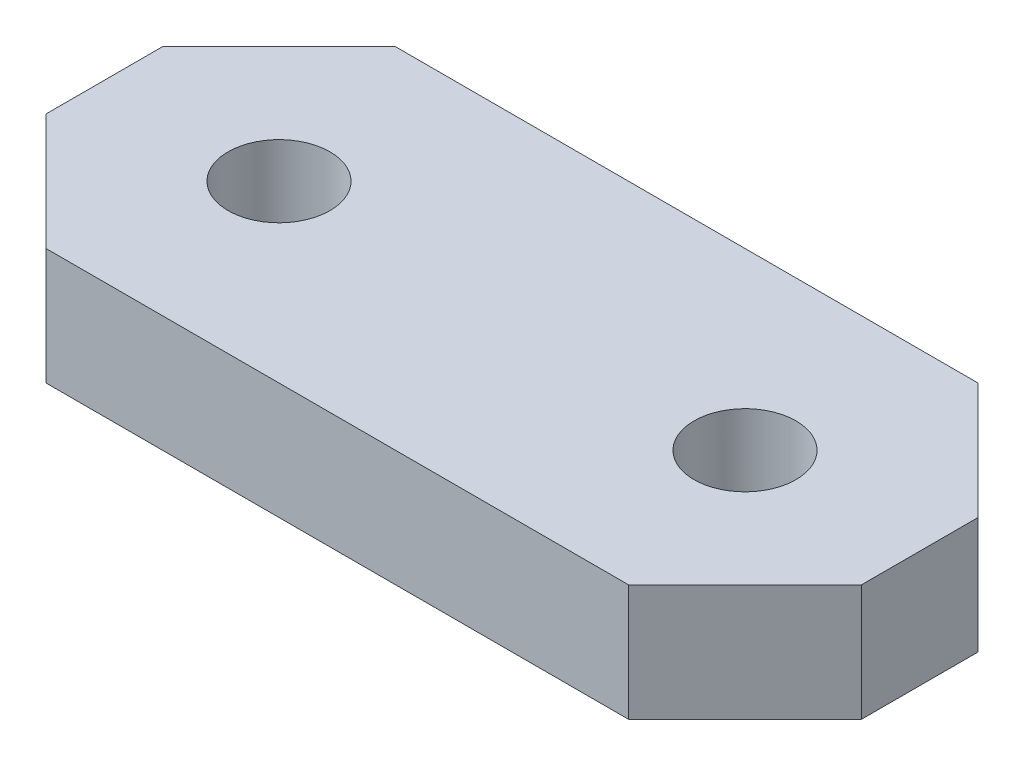
ISO-10303-21;
HEADER;
FILE_DESCRIPTION(('STEP AP214'),'2;1');
FILE_NAME('part.step','',(''),(''),'','','');
FILE_SCHEMA(('AUTOMOTIVE_DESIGN { 1 0 10303 214 1 1 1 1 }'));
ENDSEC;
DATA;
#1=APPLICATION_CONTEXT('core data for automotive mechanical design processes');
#2=APPLICATION_PROTOCOL_DEFINITION('international standard','automotive_design',2000,#1);
#3=PRODUCT_CONTEXT('',#1,'mechanical');
#4=PRODUCT('Part','Part','',(#3));
#5=PRODUCT_RELATED_PRODUCT_CATEGORY('part','',(#4));
#6=PRODUCT_DEFINITION_FORMATION('','',#4);
#7=PRODUCT_DEFINITION_CONTEXT('part definition',#1,'design');
#8=PRODUCT_DEFINITION('design','',#6,#7);
#9=PRODUCT_DEFINITION_SHAPE('','',#8);
#10=(LENGTH_UNIT() NAMED_UNIT(*) SI_UNIT(.MILLI.,.METRE.));
#11=(NAMED_UNIT(*) PLANE_ANGLE_UNIT() SI_UNIT($,.RADIAN.));
#12=(NAMED_UNIT(*) SI_UNIT($,.STERADIAN.) SOLID_ANGLE_UNIT());
#13=UNCERTAINTY_MEASURE_WITH_UNIT(LENGTH_MEASURE(1.E-05),#10,'distance_accuracy_value','');
#14=(GEOMETRIC_REPRESENTATION_CONTEXT(3) GLOBAL_UNCERTAINTY_ASSIGNED_CONTEXT((#13)) GLOBAL_UNIT_ASSIGNED_CONTEXT((#10,
#11,#12)) REPRESENTATION_CONTEXT('',''));
#15=CARTESIAN_POINT('',(0.,0.,0.));
#16=DIRECTION('',(0.,0.,1.));
#17=DIRECTION('',(1.,0.,0.));
#18=AXIS2_PLACEMENT_3D('',#15,#16,#17);
#19=CARTESIAN_POINT('',(0.,4.,12.));
#20=DIRECTION('',(1.,0.,0.));
#21=DIRECTION('',(0.,0.,-1.));
#22=AXIS2_PLACEMENT_3D('',#19,#20,#21);
#23=PLANE('',#22);
#24=DIRECTION('',(0.,0.,-1.));
#25=VECTOR('',#24,1.);
#26=CARTESIAN_POINT('',(0.,4.,12.));
#27=LINE('',#26,#25);
#28=CARTESIAN_POINT('',(0.,4.,7.99999999999999));
#29=VERTEX_POINT('',#28);
#30=CARTESIAN_POINT('',(0.,4.,4.));
#31=VERTEX_POINT('',#30);
#32=EDGE_CURVE('E161',#29,#31,#27,.T.);
#33=ORIENTED_EDGE('',*,*,#32,.T.);
#34=DIRECTION('',(0.,-1.,0.));
#35=VECTOR('',#34,1.);
#36=CARTESIAN_POINT('',(0.,4.,4.));
#37=LINE('',#36,#35);
#38=CARTESIAN_POINT('',(0.,0.,4.));
#39=VERTEX_POINT('',#38);
#40=EDGE_CURVE('E117',#31,#39,#37,.T.);
#41=ORIENTED_EDGE('',*,*,#40,.T.);
#42=DIRECTION('',(0.,0.,-1.));
#43=VECTOR('',#42,1.);
#44=CARTESIAN_POINT('',(0.,0.,12.));
#45=LINE('',#44,#43);
#46=CARTESIAN_POINT('',(0.,0.,7.99999999999999));
#47=VERTEX_POINT('',#46);
#48=EDGE_CURVE('E101',#47,#39,#45,.T.);
#49=ORIENTED_EDGE('',*,*,#48,.F.);
#50=DIRECTION('',(0.,1.,0.));
#51=VECTOR('',#50,1.);
#52=CARTESIAN_POINT('',(0.,4.,7.99999999999999));
#53=LINE('',#52,#51);
#54=EDGE_CURVE('E114',#47,#29,#53,.T.);
#55=ORIENTED_EDGE('',*,*,#54,.T.);
#56=EDGE_LOOP('',(#33,#41,#49,#55));
#57=FACE_BOUND('',#56,.T.);
#58=ADVANCED_FACE('F32',(#57),#23,.F.);
#59=CARTESIAN_POINT('',(16.,0.,12.));
#60=DIRECTION('',(0.,1.,0.));
#61=DIRECTION('',(0.,0.,1.));
#62=AXIS2_PLACEMENT_3D('',#59,#60,#61);
#63=PLANE('',#62);
#64=CARTESIAN_POINT('',(22.,0.,6.));
#65=DIRECTION('',(0.,1.,0.));
#66=DIRECTION('',(0.,0.,1.));
#67=AXIS2_PLACEMENT_3D('',#64,#65,#66);
#68=CIRCLE('',#67,1.75);
#69=CARTESIAN_POINT('',(22.,0.,7.75));
#70=VERTEX_POINT('',#69);
#71=EDGE_CURVE('E295',#70,#70,#68,.T.);
#72=ORIENTED_EDGE('',*,*,#71,.T.);
#73=EDGE_LOOP('',(#72));
#74=FACE_BOUND('',#73,.T.);
#75=CARTESIAN_POINT('',(6.,0.,6.));
#76=DIRECTION('',(0.,1.,0.));
#77=DIRECTION('',(0.,0.,1.));
#78=AXIS2_PLACEMENT_3D('',#75,#76,#77);
#79=CIRCLE('',#78,1.75);
#80=CARTESIAN_POINT('',(6.,0.,7.75));
#81=VERTEX_POINT('',#80);
#82=EDGE_CURVE('E170',#81,#81,#79,.T.);
#83=ORIENTED_EDGE('',*,*,#82,.T.);
#84=EDGE_LOOP('',(#83));
#85=FACE_BOUND('',#84,.T.);
#86=ORIENTED_EDGE('',*,*,#48,.T.);
#87=DIRECTION('',(-0.707106781186549,0.,0.707106781186546));
#88=VECTOR('',#87,1.);
#89=CARTESIAN_POINT('',(0.,0.,4.));
#90=LINE('',#89,#88);
#91=CARTESIAN_POINT('',(4.00000000000001,0.,0.));
#92=VERTEX_POINT('',#91);
#93=EDGE_CURVE('E108',#39,#92,#90,.F.);
#94=ORIENTED_EDGE('',*,*,#93,.T.);
#95=DIRECTION('',(1.,0.,0.));
#96=VECTOR('',#95,1.);
#97=CARTESIAN_POINT('',(16.,0.,0.));
#98=LINE('',#97,#96);
#99=CARTESIAN_POINT('',(24.,0.,0.));
#100=VERTEX_POINT('',#99);
#101=EDGE_CURVE('E168',#92,#100,#98,.T.);
#102=ORIENTED_EDGE('',*,*,#101,.T.);
#103=DIRECTION('',(-0.707106781186549,0.,-0.707106781186546));
#104=VECTOR('',#103,1.);
#105=CARTESIAN_POINT('',(28.,0.,4.));
#106=LINE('',#105,#104);
#107=CARTESIAN_POINT('',(28.,0.,4.));
#108=VERTEX_POINT('',#107);
#109=EDGE_CURVE('E109',#100,#108,#106,.F.);
#110=ORIENTED_EDGE('',*,*,#109,.T.);
#111=DIRECTION('',(0.,0.,-1.));
#112=VECTOR('',#111,1.);
#113=CARTESIAN_POINT('',(28.,0.,12.));
#114=LINE('',#113,#112);
#115=CARTESIAN_POINT('',(28.,0.,7.99999999999999));
#116=VERTEX_POINT('',#115);
#117=EDGE_CURVE('E118',#116,#108,#114,.T.);
#118=ORIENTED_EDGE('',*,*,#117,.F.);
#119=DIRECTION('',(-0.707106781186546,0.,0.707106781186549));
#120=VECTOR('',#119,1.);
#121=CARTESIAN_POINT('',(24.,0.,12.));
#122=LINE('',#121,#120);
#123=CARTESIAN_POINT('',(24.,0.,12.));
#124=VERTEX_POINT('',#123);
#125=EDGE_CURVE('E124',#116,#124,#122,.T.);
#126=ORIENTED_EDGE('',*,*,#125,.T.);
#127=DIRECTION('',(1.,0.,0.));
#128=VECTOR('',#127,1.);
#129=CARTESIAN_POINT('',(0.,0.,12.));
#130=LINE('',#129,#128);
#131=CARTESIAN_POINT('',(4.,0.,12.));
#132=VERTEX_POINT('',#131);
#133=EDGE_CURVE('E103',#132,#124,#130,.T.);
#134=ORIENTED_EDGE('',*,*,#133,.F.);
#135=DIRECTION('',(-0.707106781186546,0.,-0.707106781186549));
#136=VECTOR('',#135,1.);
#137=CARTESIAN_POINT('',(4.,0.,12.));
#138=LINE('',#137,#136);
#139=EDGE_CURVE('E98',#132,#47,#138,.T.);
#140=ORIENTED_EDGE('',*,*,#139,.T.);
#141=EDGE_LOOP('',(#86,#94,#102,#110,#118,#126,#134,#140));
#142=FACE_BOUND('',#141,.T.);
#143=ADVANCED_FACE('F100',(#74,#85,#142),#63,.F.);
#144=CARTESIAN_POINT('',(28.,0.,12.));
#145=DIRECTION('',(-1.,0.,0.));
#146=DIRECTION('',(0.,0.,1.));
#147=AXIS2_PLACEMENT_3D('',#144,#145,#146);
#148=PLANE('',#147);
#149=ORIENTED_EDGE('',*,*,#117,.T.);
#150=DIRECTION('',(0.,1.,0.));
#151=VECTOR('',#150,1.);
#152=CARTESIAN_POINT('',(28.,0.,4.));
#153=LINE('',#152,#151);
#154=CARTESIAN_POINT('',(28.,4.,4.));
#155=VERTEX_POINT('',#154);
#156=EDGE_CURVE('E11',#108,#155,#153,.T.);
#157=ORIENTED_EDGE('',*,*,#156,.T.);
#158=DIRECTION('',(0.,0.,-1.));
#159=VECTOR('',#158,1.);
#160=CARTESIAN_POINT('',(28.,4.,12.));
#161=LINE('',#160,#159);
#162=CARTESIAN_POINT('',(28.,4.,7.99999999999999));
#163=VERTEX_POINT('',#162);
#164=EDGE_CURVE('E149',#163,#155,#161,.T.);
#165=ORIENTED_EDGE('',*,*,#164,.F.);
#166=DIRECTION('',(0.,-1.,0.));
#167=VECTOR('',#166,1.);
#168=CARTESIAN_POINT('',(28.,0.,7.99999999999999));
#169=LINE('',#168,#167);
#170=EDGE_CURVE('E40',#163,#116,#169,.T.);
#171=ORIENTED_EDGE('',*,*,#170,.T.);
#172=EDGE_LOOP('',(#149,#157,#165,#171));
#173=FACE_BOUND('',#172,.T.);
#174=ADVANCED_FACE('F148',(#173),#148,.F.);
#175=CARTESIAN_POINT('',(28.,4.,12.));
#176=DIRECTION('',(0.,-1.,0.));
#177=DIRECTION('',(1.,0.,0.));
#178=AXIS2_PLACEMENT_3D('',#175,#176,#177);
#179=PLANE('',#178);
#180=CARTESIAN_POINT('',(22.,4.,6.));
#181=DIRECTION('',(0.,-1.,0.));
#182=DIRECTION('',(0.,0.,-1.));
#183=AXIS2_PLACEMENT_3D('',#180,#181,#182);
#184=CIRCLE('',#183,1.75);
#185=CARTESIAN_POINT('',(22.,4.,4.25));
#186=VERTEX_POINT('',#185);
#187=EDGE_CURVE('E291',#186,#186,#184,.T.);
#188=ORIENTED_EDGE('',*,*,#187,.T.);
#189=EDGE_LOOP('',(#188));
#190=FACE_BOUND('',#189,.T.);
#191=CARTESIAN_POINT('',(6.,4.,6.));
#192=DIRECTION('',(0.,-1.,0.));
#193=DIRECTION('',(0.,0.,-1.));
#194=AXIS2_PLACEMENT_3D('',#191,#192,#193);
#195=CIRCLE('',#194,1.75);
#196=CARTESIAN_POINT('',(6.,4.,4.25));
#197=VERTEX_POINT('',#196);
#198=EDGE_CURVE('E294',#197,#197,#195,.T.);
#199=ORIENTED_EDGE('',*,*,#198,.T.);
#200=EDGE_LOOP('',(#199));
#201=FACE_BOUND('',#200,.T.);
#202=DIRECTION('',(-1.,0.,0.));
#203=VECTOR('',#202,1.);
#204=CARTESIAN_POINT('',(28.,4.,0.));
#205=LINE('',#204,#203);
#206=CARTESIAN_POINT('',(24.,4.,0.));
#207=VERTEX_POINT('',#206);
#208=CARTESIAN_POINT('',(4.00000000000001,4.,0.));
#209=VERTEX_POINT('',#208);
#210=EDGE_CURVE('E164',#207,#209,#205,.T.);
#211=ORIENTED_EDGE('',*,*,#210,.T.);
#212=DIRECTION('',(0.707106781186549,0.,-0.707106781186546));
#213=VECTOR('',#212,1.);
#214=CARTESIAN_POINT('',(0.,4.,4.));
#215=LINE('',#214,#213);
#216=EDGE_CURVE('E138',#209,#31,#215,.F.);
#217=ORIENTED_EDGE('',*,*,#216,.T.);
#218=ORIENTED_EDGE('',*,*,#32,.F.);
#219=DIRECTION('',(0.707106781186546,0.,0.707106781186549));
#220=VECTOR('',#219,1.);
#221=CARTESIAN_POINT('',(4.,4.,12.));
#222=LINE('',#221,#220);
#223=CARTESIAN_POINT('',(4.,4.,12.));
#224=VERTEX_POINT('',#223);
#225=EDGE_CURVE('E122',#29,#224,#222,.T.);
#226=ORIENTED_EDGE('',*,*,#225,.T.);
#227=DIRECTION('',(-1.,0.,0.));
#228=VECTOR('',#227,1.);
#229=CARTESIAN_POINT('',(28.,4.,12.));
#230=LINE('',#229,#228);
#231=CARTESIAN_POINT('',(24.,4.,12.));
#232=VERTEX_POINT('',#231);
#233=EDGE_CURVE('E158',#232,#224,#230,.T.);
#234=ORIENTED_EDGE('',*,*,#233,.F.);
#235=DIRECTION('',(0.707106781186546,0.,-0.707106781186549));
#236=VECTOR('',#235,1.);
#237=CARTESIAN_POINT('',(24.,4.,12.));
#238=LINE('',#237,#236);
#239=EDGE_CURVE('E54',#232,#163,#238,.T.);
#240=ORIENTED_EDGE('',*,*,#239,.T.);
#241=ORIENTED_EDGE('',*,*,#164,.T.);
#242=DIRECTION('',(0.707106781186549,0.,0.707106781186546));
#243=VECTOR('',#242,1.);
#244=CARTESIAN_POINT('',(28.,4.,4.));
#245=LINE('',#244,#243);
#246=EDGE_CURVE('E47',#155,#207,#245,.F.);
#247=ORIENTED_EDGE('',*,*,#246,.T.);
#248=EDGE_LOOP('',(#211,#217,#218,#226,#234,#240,#241,#247));
#249=FACE_BOUND('',#248,.T.);
#250=ADVANCED_FACE('F160',(#190,#201,#249),#179,.F.);
#251=CARTESIAN_POINT('',(0.,0.,12.));
#252=DIRECTION('',(0.,0.,1.));
#253=DIRECTION('',(1.,0.,0.));
#254=AXIS2_PLACEMENT_3D('',#251,#252,#253);
#255=PLANE('',#254);
#256=ORIENTED_EDGE('',*,*,#233,.T.);
#257=DIRECTION('',(0.,-1.,0.));
#258=VECTOR('',#257,1.);
#259=CARTESIAN_POINT('',(4.,0.,12.));
#260=LINE('',#259,#258);
#261=EDGE_CURVE('E143',#224,#132,#260,.T.);
#262=ORIENTED_EDGE('',*,*,#261,.T.);
#263=ORIENTED_EDGE('',*,*,#133,.T.);
#264=DIRECTION('',(0.,1.,0.));
#265=VECTOR('',#264,1.);
#266=CARTESIAN_POINT('',(24.,4.,12.));
#267=LINE('',#266,#265);
#268=EDGE_CURVE('E140',#124,#232,#267,.T.);
#269=ORIENTED_EDGE('',*,*,#268,.T.);
#270=EDGE_LOOP('',(#256,#262,#263,#269));
#271=FACE_BOUND('',#270,.T.);
#272=ADVANCED_FACE('F157',(#271),#255,.T.);
#273=CARTESIAN_POINT('',(0.,0.,0.));
#274=DIRECTION('',(0.,0.,1.));
#275=DIRECTION('',(1.,0.,0.));
#276=AXIS2_PLACEMENT_3D('',#273,#274,#275);
#277=PLANE('',#276);
#278=ORIENTED_EDGE('',*,*,#101,.F.);
#279=DIRECTION('',(0.,1.,0.));
#280=VECTOR('',#279,1.);
#281=CARTESIAN_POINT('',(4.00000000000001,0.,0.));
#282=LINE('',#281,#280);
#283=EDGE_CURVE('E133',#92,#209,#282,.T.);
#284=ORIENTED_EDGE('',*,*,#283,.T.);
#285=ORIENTED_EDGE('',*,*,#210,.F.);
#286=DIRECTION('',(0.,-1.,0.));
#287=VECTOR('',#286,1.);
#288=CARTESIAN_POINT('',(24.,0.,0.));
#289=LINE('',#288,#287);
#290=EDGE_CURVE('E131',#207,#100,#289,.T.);
#291=ORIENTED_EDGE('',*,*,#290,.T.);
#292=EDGE_LOOP('',(#278,#284,#285,#291));
#293=FACE_BOUND('',#292,.T.);
#294=ADVANCED_FACE('F176',(#293),#277,.F.);
#295=CARTESIAN_POINT('',(6.,4.,6.));
#296=DIRECTION('',(0.,-1.,0.));
#297=DIRECTION('',(0.,0.,-1.));
#298=AXIS2_PLACEMENT_3D('',#295,#296,#297);
#299=CYLINDRICAL_SURFACE('',#298,1.75);
#300=ORIENTED_EDGE('',*,*,#198,.F.);
#301=EDGE_LOOP('',(#300));
#302=FACE_BOUND('',#301,.T.);
#303=ORIENTED_EDGE('',*,*,#82,.F.);
#304=EDGE_LOOP('',(#303));
#305=FACE_BOUND('',#304,.T.);
#306=ADVANCED_FACE('F201',(#302,#305),#299,.F.);
#307=CARTESIAN_POINT('',(22.,4.,6.));
#308=DIRECTION('',(0.,-1.,0.));
#309=DIRECTION('',(0.,0.,-1.));
#310=AXIS2_PLACEMENT_3D('',#307,#308,#309);
#311=CYLINDRICAL_SURFACE('',#310,1.75);
#312=ORIENTED_EDGE('',*,*,#187,.F.);
#313=EDGE_LOOP('',(#312));
#314=FACE_BOUND('',#313,.T.);
#315=ORIENTED_EDGE('',*,*,#71,.F.);
#316=EDGE_LOOP('',(#315));
#317=FACE_BOUND('',#316,.T.);
#318=ADVANCED_FACE('F196',(#314,#317),#311,.F.);
#319=CARTESIAN_POINT('',(0.,4.,4.));
#320=DIRECTION('',(0.707106781186546,0.,0.707106781186549));
#321=DIRECTION('',(0.,-1.,0.));
#322=AXIS2_PLACEMENT_3D('',#319,#320,#321);
#323=PLANE('',#322);
#324=ORIENTED_EDGE('',*,*,#216,.F.);
#325=ORIENTED_EDGE('',*,*,#283,.F.);
#326=ORIENTED_EDGE('',*,*,#93,.F.);
#327=ORIENTED_EDGE('',*,*,#40,.F.);
#328=EDGE_LOOP('',(#324,#325,#326,#327));
#329=FACE_BOUND('',#328,.T.);
#330=ADVANCED_FACE('F184',(#329),#323,.F.);
#331=CARTESIAN_POINT('',(4.,0.,12.));
#332=DIRECTION('',(-0.707106781186549,0.,0.707106781186546));
#333=DIRECTION('',(0.,1.,0.));
#334=AXIS2_PLACEMENT_3D('',#331,#332,#333);
#335=PLANE('',#334);
#336=ORIENTED_EDGE('',*,*,#225,.F.);
#337=ORIENTED_EDGE('',*,*,#54,.F.);
#338=ORIENTED_EDGE('',*,*,#139,.F.);
#339=ORIENTED_EDGE('',*,*,#261,.F.);
#340=EDGE_LOOP('',(#336,#337,#338,#339));
#341=FACE_BOUND('',#340,.T.);
#342=ADVANCED_FACE('F121',(#341),#335,.T.);
#343=CARTESIAN_POINT('',(28.,0.,4.));
#344=DIRECTION('',(-0.707106781186546,0.,0.707106781186549));
#345=DIRECTION('',(0.,1.,0.));
#346=AXIS2_PLACEMENT_3D('',#343,#344,#345);
#347=PLANE('',#346);
#348=ORIENTED_EDGE('',*,*,#109,.F.);
#349=ORIENTED_EDGE('',*,*,#290,.F.);
#350=ORIENTED_EDGE('',*,*,#246,.F.);
#351=ORIENTED_EDGE('',*,*,#156,.F.);
#352=EDGE_LOOP('',(#348,#349,#350,#351));
#353=FACE_BOUND('',#352,.T.);
#354=ADVANCED_FACE('F178',(#353),#347,.F.);
#355=CARTESIAN_POINT('',(24.,0.,12.));
#356=DIRECTION('',(0.707106781186549,0.,0.707106781186546));
#357=DIRECTION('',(0.,-1.,0.));
#358=AXIS2_PLACEMENT_3D('',#355,#356,#357);
#359=PLANE('',#358);
#360=ORIENTED_EDGE('',*,*,#125,.F.);
#361=ORIENTED_EDGE('',*,*,#170,.F.);
#362=ORIENTED_EDGE('',*,*,#239,.F.);
#363=ORIENTED_EDGE('',*,*,#268,.F.);
#364=EDGE_LOOP('',(#360,#361,#362,#363));
#365=FACE_BOUND('',#364,.T.);
#366=ADVANCED_FACE('F34',(#365),#359,.T.);
#367=CLOSED_SHELL('',(#58,#143,#174,#250,#272,#294,#306,#318,#330,#342,#354,#366));
#368=MANIFOLD_SOLID_BREP('B2',#367);
#369=ADVANCED_BREP_SHAPE_REPRESENTATION('',(#18,#368),#14);
#370=SHAPE_DEFINITION_REPRESENTATION(#9,#369);
ENDSEC;
END-ISO-10303-21;
